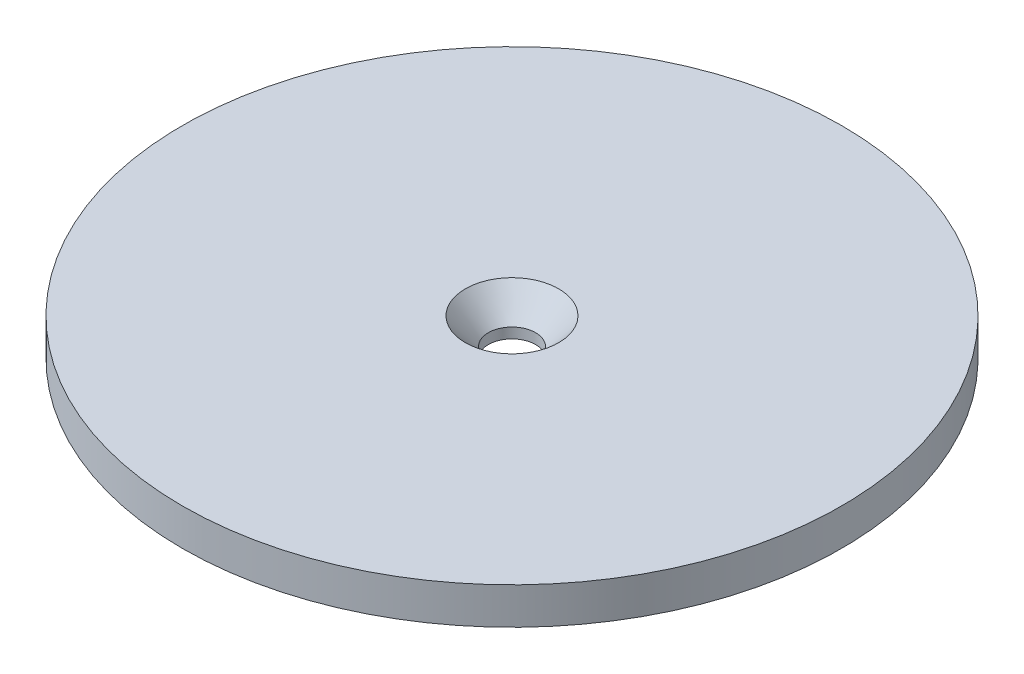
ISO-10303-21;
HEADER;
FILE_DESCRIPTION(('STEP AP214'),'2;1');
FILE_NAME('part.step','',(''),(''),'','','');
FILE_SCHEMA(('AUTOMOTIVE_DESIGN { 1 0 10303 214 1 1 1 1 }'));
ENDSEC;
DATA;
#1=APPLICATION_CONTEXT('core data for automotive mechanical design processes');
#2=APPLICATION_PROTOCOL_DEFINITION('international standard','automotive_design',2000,#1);
#3=PRODUCT_CONTEXT('',#1,'mechanical');
#4=PRODUCT('Part','Part','',(#3));
#5=PRODUCT_RELATED_PRODUCT_CATEGORY('part','',(#4));
#6=PRODUCT_DEFINITION_FORMATION('','',#4);
#7=PRODUCT_DEFINITION_CONTEXT('part definition',#1,'design');
#8=PRODUCT_DEFINITION('design','',#6,#7);
#9=PRODUCT_DEFINITION_SHAPE('','',#8);
#10=(LENGTH_UNIT() NAMED_UNIT(*) SI_UNIT(.MILLI.,.METRE.));
#11=(NAMED_UNIT(*) PLANE_ANGLE_UNIT() SI_UNIT($,.RADIAN.));
#12=(NAMED_UNIT(*) SI_UNIT($,.STERADIAN.) SOLID_ANGLE_UNIT());
#13=UNCERTAINTY_MEASURE_WITH_UNIT(LENGTH_MEASURE(1.E-05),#10,'distance_accuracy_value','');
#14=(GEOMETRIC_REPRESENTATION_CONTEXT(3) GLOBAL_UNCERTAINTY_ASSIGNED_CONTEXT((#13)) GLOBAL_UNIT_ASSIGNED_CONTEXT((#10,
#11,#12)) REPRESENTATION_CONTEXT('',''));
#15=CARTESIAN_POINT('',(0.,0.,0.));
#16=DIRECTION('',(0.,0.,1.));
#17=DIRECTION('',(1.,0.,0.));
#18=AXIS2_PLACEMENT_3D('',#15,#16,#17);
#19=CARTESIAN_POINT('',(0.,25.4,0.));
#20=DIRECTION('',(0.,-1.,0.));
#21=DIRECTION('',(0.,0.,-1.));
#22=AXIS2_PLACEMENT_3D('',#19,#20,#21);
#23=CYLINDRICAL_SURFACE('',#22,45.466);
#24=CARTESIAN_POINT('',(0.,25.4,0.));
#25=DIRECTION('',(0.,1.,0.));
#26=DIRECTION('',(0.,0.,1.));
#27=AXIS2_PLACEMENT_3D('',#24,#25,#26);
#28=CIRCLE('',#27,45.466);
#29=CARTESIAN_POINT('',(0.,25.4,45.466));
#30=VERTEX_POINT('',#29);
#31=EDGE_CURVE('E10',#30,#30,#28,.T.);
#32=ORIENTED_EDGE('',*,*,#31,.F.);
#33=EDGE_LOOP('',(#32));
#34=FACE_BOUND('',#33,.T.);
#35=CARTESIAN_POINT('',(0.,20.322357612504,0.));
#36=DIRECTION('',(0.,-1.,0.));
#37=DIRECTION('',(0.,0.,-1.));
#38=AXIS2_PLACEMENT_3D('',#35,#36,#37);
#39=CIRCLE('',#38,45.466);
#40=CARTESIAN_POINT('',(0.,20.322357612504,-45.466));
#41=VERTEX_POINT('',#40);
#42=EDGE_CURVE('E52',#41,#41,#39,.T.);
#43=ORIENTED_EDGE('',*,*,#42,.F.);
#44=EDGE_LOOP('',(#43));
#45=FACE_BOUND('',#44,.T.);
#46=ADVANCED_FACE('F36',(#34,#45),#23,.T.);
#47=CARTESIAN_POINT('',(0.,25.4,0.));
#48=DIRECTION('',(0.,1.,0.));
#49=DIRECTION('',(0.,0.,1.));
#50=AXIS2_PLACEMENT_3D('',#47,#48,#49);
#51=CYLINDRICAL_SURFACE('',#50,3.26389999999999);
#52=CARTESIAN_POINT('',(0.,21.7475803070733,0.));
#53=DIRECTION('',(0.,1.,0.));
#54=DIRECTION('',(0.,0.,1.));
#55=AXIS2_PLACEMENT_3D('',#52,#53,#54);
#56=CIRCLE('',#55,3.2639);
#57=CARTESIAN_POINT('',(0.,21.7475803070733,3.2639));
#58=VERTEX_POINT('',#57);
#59=EDGE_CURVE('E43',#58,#58,#56,.T.);
#60=ORIENTED_EDGE('',*,*,#59,.T.);
#61=EDGE_LOOP('',(#60));
#62=FACE_BOUND('',#61,.T.);
#63=CARTESIAN_POINT('',(0.,20.322357612504,0.));
#64=DIRECTION('',(0.,-1.,0.));
#65=DIRECTION('',(0.,0.,-1.));
#66=AXIS2_PLACEMENT_3D('',#63,#64,#65);
#67=CIRCLE('',#66,3.26389999999999);
#68=CARTESIAN_POINT('',(0.,20.322357612504,-3.26389999999999));
#69=VERTEX_POINT('',#68);
#70=EDGE_CURVE('E39',#69,#69,#67,.F.);
#71=ORIENTED_EDGE('',*,*,#70,.F.);
#72=EDGE_LOOP('',(#71));
#73=FACE_BOUND('',#72,.T.);
#74=ADVANCED_FACE('F61',(#62,#73),#51,.F.);
#75=CARTESIAN_POINT('',(0.,25.4,0.));
#76=DIRECTION('',(0.,1.,0.));
#77=DIRECTION('',(0.,0.,1.));
#78=AXIS2_PLACEMENT_3D('',#75,#76,#77);
#79=PLANE('',#78);
#80=CARTESIAN_POINT('',(0.,25.4,0.));
#81=DIRECTION('',(0.,1.,0.));
#82=DIRECTION('',(0.,0.,1.));
#83=AXIS2_PLACEMENT_3D('',#80,#81,#82);
#84=CIRCLE('',#83,6.4389);
#85=CARTESIAN_POINT('',(0.,25.4,6.4389));
#86=VERTEX_POINT('',#85);
#87=EDGE_CURVE('E47',#86,#86,#84,.T.);
#88=ORIENTED_EDGE('',*,*,#87,.F.);
#89=EDGE_LOOP('',(#88));
#90=FACE_BOUND('',#89,.T.);
#91=ORIENTED_EDGE('',*,*,#31,.T.);
#92=EDGE_LOOP('',(#91));
#93=FACE_BOUND('',#92,.T.);
#94=ADVANCED_FACE('F63',(#90,#93),#79,.T.);
#95=CARTESIAN_POINT('',(0.,25.4,0.));
#96=DIRECTION('',(0.,1.,0.));
#97=DIRECTION('',(0.,0.,1.));
#98=AXIS2_PLACEMENT_3D('',#95,#96,#97);
#99=CONICAL_SURFACE('',#98,6.4389,0.715584993317675);
#100=ORIENTED_EDGE('',*,*,#59,.F.);
#101=EDGE_LOOP('',(#100));
#102=FACE_BOUND('',#101,.T.);
#103=ORIENTED_EDGE('',*,*,#87,.T.);
#104=EDGE_LOOP('',(#103));
#105=FACE_BOUND('',#104,.T.);
#106=ADVANCED_FACE('F70',(#102,#105),#99,.F.);
#107=CARTESIAN_POINT('',(0.,20.322357612504,0.));
#108=DIRECTION('',(0.,-1.,0.));
#109=DIRECTION('',(0.,0.,-1.));
#110=AXIS2_PLACEMENT_3D('',#107,#108,#109);
#111=PLANE('',#110);
#112=ORIENTED_EDGE('',*,*,#70,.T.);
#113=EDGE_LOOP('',(#112));
#114=FACE_BOUND('',#113,.T.);
#115=ORIENTED_EDGE('',*,*,#42,.T.);
#116=EDGE_LOOP('',(#115));
#117=FACE_BOUND('',#116,.T.);
#118=ADVANCED_FACE('F59',(#114,#117),#111,.T.);
#119=CLOSED_SHELL('',(#46,#74,#94,#106,#118));
#120=MANIFOLD_SOLID_BREP('B2',#119);
#121=ADVANCED_BREP_SHAPE_REPRESENTATION('',(#18,#120),#14);
#122=SHAPE_DEFINITION_REPRESENTATION(#9,#121);
ENDSEC;
END-ISO-10303-21;
